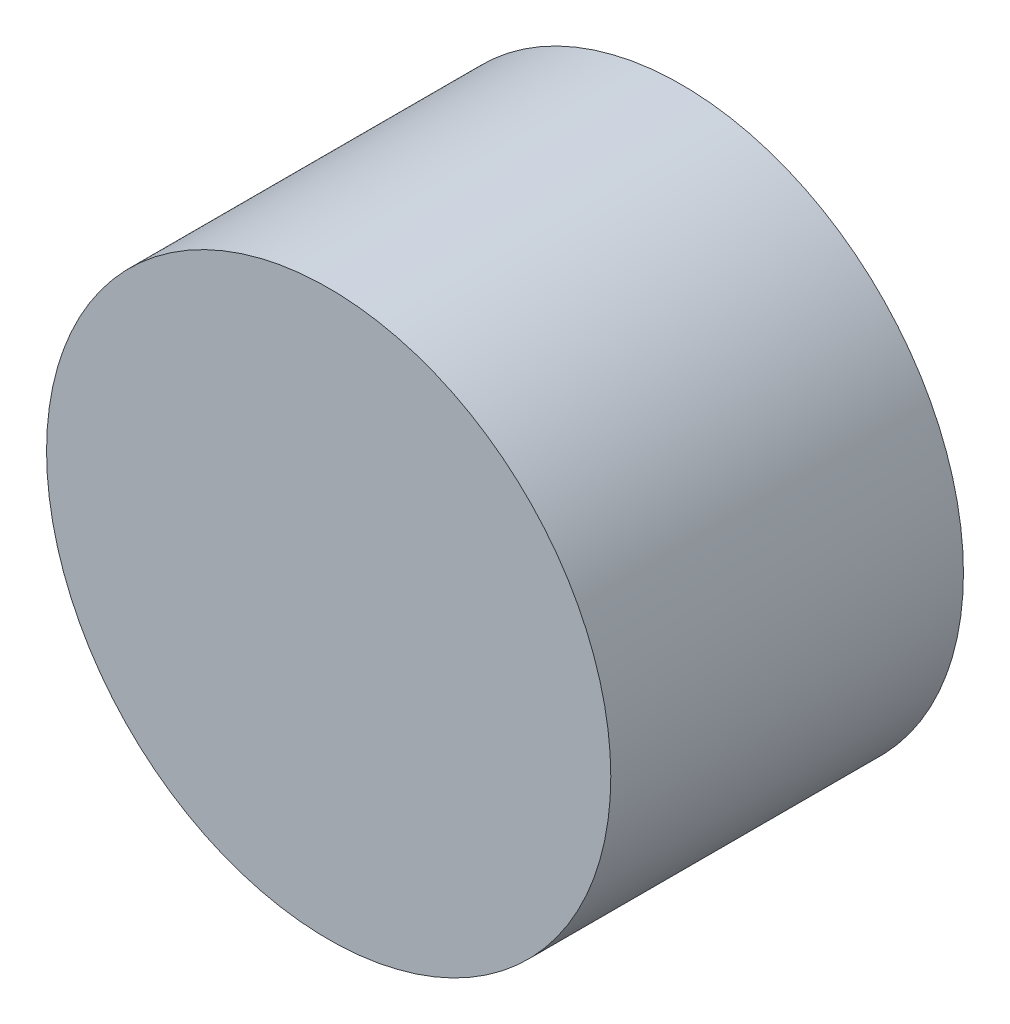
ISO-10303-21;
HEADER;
FILE_DESCRIPTION(('STEP AP214'),'2;1');
FILE_NAME('part.step','',(''),(''),'','','');
FILE_SCHEMA(('AUTOMOTIVE_DESIGN { 1 0 10303 214 1 1 1 1 }'));
ENDSEC;
DATA;
#1=APPLICATION_CONTEXT('core data for automotive mechanical design processes');
#2=APPLICATION_PROTOCOL_DEFINITION('international standard','automotive_design',2000,#1);
#3=PRODUCT_CONTEXT('',#1,'mechanical');
#4=PRODUCT('Part','Part','',(#3));
#5=PRODUCT_RELATED_PRODUCT_CATEGORY('part','',(#4));
#6=PRODUCT_DEFINITION_FORMATION('','',#4);
#7=PRODUCT_DEFINITION_CONTEXT('part definition',#1,'design');
#8=PRODUCT_DEFINITION('design','',#6,#7);
#9=PRODUCT_DEFINITION_SHAPE('','',#8);
#10=(LENGTH_UNIT() NAMED_UNIT(*) SI_UNIT(.MILLI.,.METRE.));
#11=(NAMED_UNIT(*) PLANE_ANGLE_UNIT() SI_UNIT($,.RADIAN.));
#12=(NAMED_UNIT(*) SI_UNIT($,.STERADIAN.) SOLID_ANGLE_UNIT());
#13=UNCERTAINTY_MEASURE_WITH_UNIT(LENGTH_MEASURE(1.E-05),#10,'distance_accuracy_value','');
#14=(GEOMETRIC_REPRESENTATION_CONTEXT(3) GLOBAL_UNCERTAINTY_ASSIGNED_CONTEXT((#13)) GLOBAL_UNIT_ASSIGNED_CONTEXT((#10,
#11,#12)) REPRESENTATION_CONTEXT('',''));
#15=CARTESIAN_POINT('',(0.,0.,0.));
#16=DIRECTION('',(0.,0.,1.));
#17=DIRECTION('',(1.,0.,0.));
#18=AXIS2_PLACEMENT_3D('',#15,#16,#17);
#19=CARTESIAN_POINT('',(-250.,87.4999999999999,25.));
#20=DIRECTION('',(0.,0.,-1.));
#21=DIRECTION('',(-1.,0.,0.));
#22=AXIS2_PLACEMENT_3D('',#19,#20,#21);
#23=CYLINDRICAL_SURFACE('',#22,20.);
#24=CARTESIAN_POINT('',(-250.,87.4999999999999,0.));
#25=DIRECTION('',(0.,0.,1.));
#26=DIRECTION('',(1.,0.,0.));
#27=AXIS2_PLACEMENT_3D('',#24,#25,#26);
#28=CIRCLE('',#27,20.);
#29=CARTESIAN_POINT('',(-230.,87.4999999999999,0.));
#30=VERTEX_POINT('',#29);
#31=EDGE_CURVE('E36',#30,#30,#28,.T.);
#32=ORIENTED_EDGE('',*,*,#31,.T.);
#33=EDGE_LOOP('',(#32));
#34=FACE_BOUND('',#33,.T.);
#35=CARTESIAN_POINT('',(-250.,87.4999999999999,25.));
#36=DIRECTION('',(0.,0.,1.));
#37=DIRECTION('',(1.,0.,0.));
#38=AXIS2_PLACEMENT_3D('',#35,#36,#37);
#39=CIRCLE('',#38,20.);
#40=CARTESIAN_POINT('',(-230.,87.4999999999999,25.));
#41=VERTEX_POINT('',#40);
#42=EDGE_CURVE('E10',#41,#41,#39,.T.);
#43=ORIENTED_EDGE('',*,*,#42,.F.);
#44=EDGE_LOOP('',(#43));
#45=FACE_BOUND('',#44,.T.);
#46=ADVANCED_FACE('F33',(#34,#45),#23,.T.);
#47=CARTESIAN_POINT('',(-250.,87.4999999999999,25.));
#48=DIRECTION('',(0.,0.,1.));
#49=DIRECTION('',(1.,0.,0.));
#50=AXIS2_PLACEMENT_3D('',#47,#48,#49);
#51=PLANE('',#50);
#52=ORIENTED_EDGE('',*,*,#42,.T.);
#53=EDGE_LOOP('',(#52));
#54=FACE_BOUND('',#53,.T.);
#55=ADVANCED_FACE('F49',(#54),#51,.T.);
#56=CARTESIAN_POINT('',(-250.,87.4999999999999,0.));
#57=DIRECTION('',(0.,0.,1.));
#58=DIRECTION('',(1.,0.,0.));
#59=AXIS2_PLACEMENT_3D('',#56,#57,#58);
#60=PLANE('',#59);
#61=ORIENTED_EDGE('',*,*,#31,.F.);
#62=EDGE_LOOP('',(#61));
#63=FACE_BOUND('',#62,.T.);
#64=ADVANCED_FACE('F47',(#63),#60,.F.);
#65=CLOSED_SHELL('',(#46,#55,#64));
#66=MANIFOLD_SOLID_BREP('B2',#65);
#67=ADVANCED_BREP_SHAPE_REPRESENTATION('',(#18,#66),#14);
#68=SHAPE_DEFINITION_REPRESENTATION(#9,#67);
ENDSEC;
END-ISO-10303-21;
